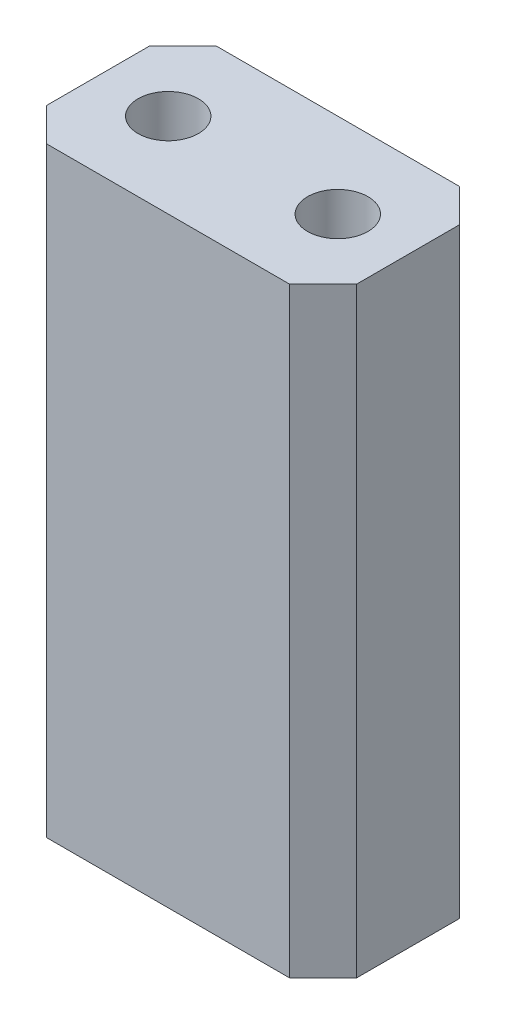
ISO-10303-21;
HEADER;
FILE_DESCRIPTION(('STEP AP214'),'2;1');
FILE_NAME('part.step','',(''),(''),'','','');
FILE_SCHEMA(('AUTOMOTIVE_DESIGN { 1 0 10303 214 1 1 1 1 }'));
ENDSEC;
DATA;
#1=APPLICATION_CONTEXT('core data for automotive mechanical design processes');
#2=APPLICATION_PROTOCOL_DEFINITION('international standard','automotive_design',2000,#1);
#3=PRODUCT_CONTEXT('',#1,'mechanical');
#4=PRODUCT('Part','Part','',(#3));
#5=PRODUCT_RELATED_PRODUCT_CATEGORY('part','',(#4));
#6=PRODUCT_DEFINITION_FORMATION('','',#4);
#7=PRODUCT_DEFINITION_CONTEXT('part definition',#1,'design');
#8=PRODUCT_DEFINITION('design','',#6,#7);
#9=PRODUCT_DEFINITION_SHAPE('','',#8);
#10=(LENGTH_UNIT() NAMED_UNIT(*) SI_UNIT(.MILLI.,.METRE.));
#11=(NAMED_UNIT(*) PLANE_ANGLE_UNIT() SI_UNIT($,.RADIAN.));
#12=(NAMED_UNIT(*) SI_UNIT($,.STERADIAN.) SOLID_ANGLE_UNIT());
#13=UNCERTAINTY_MEASURE_WITH_UNIT(LENGTH_MEASURE(1.E-05),#10,'distance_accuracy_value','');
#14=(GEOMETRIC_REPRESENTATION_CONTEXT(3) GLOBAL_UNCERTAINTY_ASSIGNED_CONTEXT((#13)) GLOBAL_UNIT_ASSIGNED_CONTEXT((#10,
#11,#12)) REPRESENTATION_CONTEXT('',''));
#15=CARTESIAN_POINT('',(0.,0.,0.));
#16=DIRECTION('',(0.,0.,1.));
#17=DIRECTION('',(1.,0.,0.));
#18=AXIS2_PLACEMENT_3D('',#15,#16,#17);
#19=CARTESIAN_POINT('',(0.,6.,0.));
#20=DIRECTION('',(0.,-1.,0.));
#21=DIRECTION('',(0.,0.,-1.));
#22=AXIS2_PLACEMENT_3D('',#19,#20,#21);
#23=PLANE('',#22);
#24=DIRECTION('',(0.,0.,-1.));
#25=VECTOR('',#24,1.);
#26=CARTESIAN_POINT('',(-0.95,6.,0.32));
#27=LINE('',#26,#25);
#28=CARTESIAN_POINT('',(-0.95,6.,0.32));
#29=VERTEX_POINT('',#28);
#30=CARTESIAN_POINT('',(-0.95,6.,-0.32));
#31=VERTEX_POINT('',#30);
#32=EDGE_CURVE('E163',#29,#31,#27,.T.);
#33=ORIENTED_EDGE('',*,*,#32,.F.);
#34=CARTESIAN_POINT('',(-1.27,6.,0.));
#35=DIRECTION('',(0.,1.,0.));
#36=DIRECTION('',(0.,0.,1.));
#37=AXIS2_PLACEMENT_3D('',#34,#35,#36);
#38=CIRCLE('',#37,0.45254833995939);
#39=EDGE_CURVE('E151',#29,#31,#38,.T.);
#40=ORIENTED_EDGE('',*,*,#39,.T.);
#41=EDGE_LOOP('',(#33,#40));
#42=FACE_BOUND('',#41,.T.);
#43=ADVANCED_FACE('F35',(#42),#23,.F.);
#44=DIRECTION('',(-1.,0.,0.));
#45=VECTOR('',#44,1.);
#46=CARTESIAN_POINT('',(-1.59,6.,-0.32));
#47=LINE('',#46,#45);
#48=CARTESIAN_POINT('',(-1.59,6.,-0.32));
#49=VERTEX_POINT('',#48);
#50=EDGE_CURVE('E176',#31,#49,#47,.T.);
#51=ORIENTED_EDGE('',*,*,#50,.F.);
#52=EDGE_CURVE('E148',#31,#49,#38,.T.);
#53=ORIENTED_EDGE('',*,*,#52,.T.);
#54=EDGE_LOOP('',(#51,#53));
#55=FACE_BOUND('',#54,.T.);
#56=ADVANCED_FACE('F187',(#55),#23,.F.);
#57=DIRECTION('',(0.,0.,1.));
#58=VECTOR('',#57,1.);
#59=CARTESIAN_POINT('',(-1.59,6.,0.32));
#60=LINE('',#59,#58);
#61=CARTESIAN_POINT('',(-1.59,6.,0.32));
#62=VERTEX_POINT('',#61);
#63=EDGE_CURVE('E188',#49,#62,#60,.T.);
#64=ORIENTED_EDGE('',*,*,#63,.F.);
#65=EDGE_CURVE('E154',#49,#62,#38,.T.);
#66=ORIENTED_EDGE('',*,*,#65,.T.);
#67=EDGE_LOOP('',(#64,#66));
#68=FACE_BOUND('',#67,.T.);
#69=ADVANCED_FACE('F361',(#68),#23,.F.);
#70=DIRECTION('',(1.,0.,0.));
#71=VECTOR('',#70,1.);
#72=CARTESIAN_POINT('',(-1.59,6.,0.32));
#73=LINE('',#72,#71);
#74=EDGE_CURVE('E191',#62,#29,#73,.T.);
#75=ORIENTED_EDGE('',*,*,#74,.F.);
#76=EDGE_CURVE('E166',#62,#29,#38,.T.);
#77=ORIENTED_EDGE('',*,*,#76,.T.);
#78=EDGE_LOOP('',(#75,#77));
#79=FACE_BOUND('',#78,.T.);
#80=ADVANCED_FACE('F365',(#79),#23,.F.);
#81=DIRECTION('',(0.,0.,-1.));
#82=VECTOR('',#81,1.);
#83=CARTESIAN_POINT('',(1.59,6.,0.32));
#84=LINE('',#83,#82);
#85=CARTESIAN_POINT('',(1.59,6.,0.32));
#86=VERTEX_POINT('',#85);
#87=CARTESIAN_POINT('',(1.59,6.,-0.320000000000001));
#88=VERTEX_POINT('',#87);
#89=EDGE_CURVE('E278',#86,#88,#84,.T.);
#90=ORIENTED_EDGE('',*,*,#89,.F.);
#91=CARTESIAN_POINT('',(1.27,6.,0.));
#92=DIRECTION('',(0.,1.,0.));
#93=DIRECTION('',(0.,0.,1.));
#94=AXIS2_PLACEMENT_3D('',#91,#92,#93);
#95=CIRCLE('',#94,0.452548339959391);
#96=EDGE_CURVE('E325',#86,#88,#95,.T.);
#97=ORIENTED_EDGE('',*,*,#96,.T.);
#98=EDGE_LOOP('',(#90,#97));
#99=FACE_BOUND('',#98,.T.);
#100=ADVANCED_FACE('F324',(#99),#23,.F.);
#101=DIRECTION('',(-1.,0.,0.));
#102=VECTOR('',#101,1.);
#103=CARTESIAN_POINT('',(0.95,6.,-0.32));
#104=LINE('',#103,#102);
#105=CARTESIAN_POINT('',(0.95,6.,-0.32));
#106=VERTEX_POINT('',#105);
#107=EDGE_CURVE('E281',#88,#106,#104,.T.);
#108=ORIENTED_EDGE('',*,*,#107,.F.);
#109=EDGE_CURVE('E329',#88,#106,#95,.T.);
#110=ORIENTED_EDGE('',*,*,#109,.T.);
#111=EDGE_LOOP('',(#108,#110));
#112=FACE_BOUND('',#111,.T.);
#113=ADVANCED_FACE('F342',(#112),#23,.F.);
#114=DIRECTION('',(0.,0.,1.));
#115=VECTOR('',#114,1.);
#116=CARTESIAN_POINT('',(0.95,6.,0.32));
#117=LINE('',#116,#115);
#118=CARTESIAN_POINT('',(0.95,6.,0.32));
#119=VERTEX_POINT('',#118);
#120=EDGE_CURVE('E285',#106,#119,#117,.T.);
#121=ORIENTED_EDGE('',*,*,#120,.F.);
#122=EDGE_CURVE('E334',#106,#119,#95,.T.);
#123=ORIENTED_EDGE('',*,*,#122,.T.);
#124=EDGE_LOOP('',(#121,#123));
#125=FACE_BOUND('',#124,.T.);
#126=ADVANCED_FACE('F339',(#125),#23,.F.);
#127=DIRECTION('',(1.,0.,0.));
#128=VECTOR('',#127,1.);
#129=CARTESIAN_POINT('',(0.95,6.,0.32));
#130=LINE('',#129,#128);
#131=EDGE_CURVE('E288',#119,#86,#130,.T.);
#132=ORIENTED_EDGE('',*,*,#131,.F.);
#133=EDGE_CURVE('E220',#119,#86,#95,.T.);
#134=ORIENTED_EDGE('',*,*,#133,.T.);
#135=EDGE_LOOP('',(#132,#134));
#136=FACE_BOUND('',#135,.T.);
#137=ADVANCED_FACE('F347',(#136),#23,.F.);
#138=CARTESIAN_POINT('',(0.,0.,0.));
#139=DIRECTION('',(0.,-1.,0.));
#140=DIRECTION('',(0.,0.,-1.));
#141=AXIS2_PLACEMENT_3D('',#138,#139,#140);
#142=PLANE('',#141);
#143=DIRECTION('',(0.,0.,-1.));
#144=VECTOR('',#143,1.);
#145=CARTESIAN_POINT('',(2.32,0.,1.27));
#146=LINE('',#145,#144);
#147=CARTESIAN_POINT('',(2.32,0.,0.77));
#148=VERTEX_POINT('',#147);
#149=CARTESIAN_POINT('',(2.32,0.,-0.769999999999999));
#150=VERTEX_POINT('',#149);
#151=EDGE_CURVE('E184',#148,#150,#146,.T.);
#152=ORIENTED_EDGE('',*,*,#151,.F.);
#153=DIRECTION('',(0.707106781186549,0.,-0.707106781186546));
#154=VECTOR('',#153,1.);
#155=CARTESIAN_POINT('',(1.545,0.,1.545));
#156=LINE('',#155,#154);
#157=CARTESIAN_POINT('',(1.82,0.,1.27));
#158=VERTEX_POINT('',#157);
#159=EDGE_CURVE('E231',#148,#158,#156,.F.);
#160=ORIENTED_EDGE('',*,*,#159,.T.);
#161=DIRECTION('',(1.,0.,0.));
#162=VECTOR('',#161,1.);
#163=CARTESIAN_POINT('',(-2.32,0.,1.27));
#164=LINE('',#163,#162);
#165=CARTESIAN_POINT('',(-1.82,0.,1.27));
#166=VERTEX_POINT('',#165);
#167=EDGE_CURVE('E217',#166,#158,#164,.T.);
#168=ORIENTED_EDGE('',*,*,#167,.F.);
#169=DIRECTION('',(0.707106781186546,0.,0.707106781186549));
#170=VECTOR('',#169,1.);
#171=CARTESIAN_POINT('',(-1.545,0.,1.545));
#172=LINE('',#171,#170);
#173=CARTESIAN_POINT('',(-2.32,0.,0.769999999999998));
#174=VERTEX_POINT('',#173);
#175=EDGE_CURVE('E229',#166,#174,#172,.F.);
#176=ORIENTED_EDGE('',*,*,#175,.T.);
#177=DIRECTION('',(0.,0.,1.));
#178=VECTOR('',#177,1.);
#179=CARTESIAN_POINT('',(-2.32,0.,-1.27));
#180=LINE('',#179,#178);
#181=CARTESIAN_POINT('',(-2.32,0.,-0.77));
#182=VERTEX_POINT('',#181);
#183=EDGE_CURVE('E215',#182,#174,#180,.T.);
#184=ORIENTED_EDGE('',*,*,#183,.F.);
#185=DIRECTION('',(-0.707106781186549,0.,0.707106781186546));
#186=VECTOR('',#185,1.);
#187=CARTESIAN_POINT('',(-1.545,0.,-1.545));
#188=LINE('',#187,#186);
#189=CARTESIAN_POINT('',(-1.82,0.,-1.27));
#190=VERTEX_POINT('',#189);
#191=EDGE_CURVE('E227',#182,#190,#188,.F.);
#192=ORIENTED_EDGE('',*,*,#191,.T.);
#193=DIRECTION('',(-1.,0.,0.));
#194=VECTOR('',#193,1.);
#195=CARTESIAN_POINT('',(-2.32,0.,-1.27));
#196=LINE('',#195,#194);
#197=CARTESIAN_POINT('',(1.82,0.,-1.27));
#198=VERTEX_POINT('',#197);
#199=EDGE_CURVE('E212',#198,#190,#196,.T.);
#200=ORIENTED_EDGE('',*,*,#199,.F.);
#201=DIRECTION('',(-0.707106781186546,0.,-0.707106781186549));
#202=VECTOR('',#201,1.);
#203=CARTESIAN_POINT('',(1.54500000000001,0.,-1.545));
#204=LINE('',#203,#202);
#205=EDGE_CURVE('E225',#198,#150,#204,.F.);
#206=ORIENTED_EDGE('',*,*,#205,.T.);
#207=EDGE_LOOP('',(#152,#160,#168,#176,#184,#192,#200,#206));
#208=FACE_BOUND('',#207,.T.);
#209=DIRECTION('',(1.,0.,0.));
#210=VECTOR('',#209,1.);
#211=CARTESIAN_POINT('',(-1.59,0.,0.32));
#212=LINE('',#211,#210);
#213=CARTESIAN_POINT('',(-1.59,0.,0.32));
#214=VERTEX_POINT('',#213);
#215=CARTESIAN_POINT('',(-0.95,0.,0.32));
#216=VERTEX_POINT('',#215);
#217=EDGE_CURVE('E177',#214,#216,#212,.T.);
#218=ORIENTED_EDGE('',*,*,#217,.T.);
#219=DIRECTION('',(0.,0.,-1.));
#220=VECTOR('',#219,1.);
#221=CARTESIAN_POINT('',(-0.95,0.,0.32));
#222=LINE('',#221,#220);
#223=CARTESIAN_POINT('',(-0.95,0.,-0.32));
#224=VERTEX_POINT('',#223);
#225=EDGE_CURVE('E197',#216,#224,#222,.T.);
#226=ORIENTED_EDGE('',*,*,#225,.T.);
#227=DIRECTION('',(-1.,0.,0.));
#228=VECTOR('',#227,1.);
#229=CARTESIAN_POINT('',(-1.59,0.,-0.32));
#230=LINE('',#229,#228);
#231=CARTESIAN_POINT('',(-1.59,0.,-0.32));
#232=VERTEX_POINT('',#231);
#233=EDGE_CURVE('E183',#224,#232,#230,.T.);
#234=ORIENTED_EDGE('',*,*,#233,.T.);
#235=DIRECTION('',(0.,0.,1.));
#236=VECTOR('',#235,1.);
#237=CARTESIAN_POINT('',(-1.59,0.,0.32));
#238=LINE('',#237,#236);
#239=EDGE_CURVE('E201',#232,#214,#238,.T.);
#240=ORIENTED_EDGE('',*,*,#239,.T.);
#241=EDGE_LOOP('',(#218,#226,#234,#240));
#242=FACE_BOUND('',#241,.T.);
#243=DIRECTION('',(1.,0.,0.));
#244=VECTOR('',#243,1.);
#245=CARTESIAN_POINT('',(0.95,0.,0.32));
#246=LINE('',#245,#244);
#247=CARTESIAN_POINT('',(0.95,0.,0.32));
#248=VERTEX_POINT('',#247);
#249=CARTESIAN_POINT('',(1.59,0.,0.32));
#250=VERTEX_POINT('',#249);
#251=EDGE_CURVE('E282',#248,#250,#246,.T.);
#252=ORIENTED_EDGE('',*,*,#251,.T.);
#253=DIRECTION('',(0.,0.,-1.));
#254=VECTOR('',#253,1.);
#255=CARTESIAN_POINT('',(1.59,0.,0.32));
#256=LINE('',#255,#254);
#257=CARTESIAN_POINT('',(1.59,0.,-0.32));
#258=VERTEX_POINT('',#257);
#259=EDGE_CURVE('E272',#250,#258,#256,.T.);
#260=ORIENTED_EDGE('',*,*,#259,.T.);
#261=DIRECTION('',(-1.,0.,0.));
#262=VECTOR('',#261,1.);
#263=CARTESIAN_POINT('',(0.95,0.,-0.32));
#264=LINE('',#263,#262);
#265=CARTESIAN_POINT('',(0.95,0.,-0.32));
#266=VERTEX_POINT('',#265);
#267=EDGE_CURVE('E294',#258,#266,#264,.T.);
#268=ORIENTED_EDGE('',*,*,#267,.T.);
#269=DIRECTION('',(0.,0.,1.));
#270=VECTOR('',#269,1.);
#271=CARTESIAN_POINT('',(0.95,0.,0.32));
#272=LINE('',#271,#270);
#273=EDGE_CURVE('E297',#266,#248,#272,.T.);
#274=ORIENTED_EDGE('',*,*,#273,.T.);
#275=EDGE_LOOP('',(#252,#260,#268,#274));
#276=FACE_BOUND('',#275,.T.);
#277=ADVANCED_FACE('F260',(#208,#242,#276),#142,.T.);
#278=CARTESIAN_POINT('',(2.32,6.,1.27));
#279=DIRECTION('',(-1.,0.,0.));
#280=DIRECTION('',(0.,0.,1.));
#281=AXIS2_PLACEMENT_3D('',#278,#279,#280);
#282=PLANE('',#281);
#283=DIRECTION('',(0.,0.,-1.));
#284=VECTOR('',#283,1.);
#285=CARTESIAN_POINT('',(2.32,9.,1.27));
#286=LINE('',#285,#284);
#287=CARTESIAN_POINT('',(2.32,9.,0.77));
#288=VERTEX_POINT('',#287);
#289=CARTESIAN_POINT('',(2.32,9.,-0.769999999999999));
#290=VERTEX_POINT('',#289);
#291=EDGE_CURVE('E274',#288,#290,#286,.T.);
#292=ORIENTED_EDGE('',*,*,#291,.F.);
#293=DIRECTION('',(0.,-1.,0.));
#294=VECTOR('',#293,1.);
#295=CARTESIAN_POINT('',(2.32,6.,0.77));
#296=LINE('',#295,#294);
#297=EDGE_CURVE('E222',#288,#148,#296,.T.);
#298=ORIENTED_EDGE('',*,*,#297,.T.);
#299=ORIENTED_EDGE('',*,*,#151,.T.);
#300=DIRECTION('',(0.,1.,0.));
#301=VECTOR('',#300,1.);
#302=CARTESIAN_POINT('',(2.32,6.,-0.769999999999999));
#303=LINE('',#302,#301);
#304=EDGE_CURVE('E158',#150,#290,#303,.T.);
#305=ORIENTED_EDGE('',*,*,#304,.T.);
#306=EDGE_LOOP('',(#292,#298,#299,#305));
#307=FACE_BOUND('',#306,.T.);
#308=ADVANCED_FACE('F354',(#307),#282,.F.);
#309=CARTESIAN_POINT('',(-2.32,6.,-1.27));
#310=DIRECTION('',(0.,0.,1.));
#311=DIRECTION('',(1.,0.,0.));
#312=AXIS2_PLACEMENT_3D('',#309,#310,#311);
#313=PLANE('',#312);
#314=ORIENTED_EDGE('',*,*,#199,.T.);
#315=DIRECTION('',(0.,1.,0.));
#316=VECTOR('',#315,1.);
#317=CARTESIAN_POINT('',(-1.82,6.,-1.27));
#318=LINE('',#317,#316);
#319=CARTESIAN_POINT('',(-1.82,9.,-1.27));
#320=VERTEX_POINT('',#319);
#321=EDGE_CURVE('E11',#190,#320,#318,.T.);
#322=ORIENTED_EDGE('',*,*,#321,.T.);
#323=DIRECTION('',(-1.,0.,0.));
#324=VECTOR('',#323,1.);
#325=CARTESIAN_POINT('',(-2.32,9.,-1.27));
#326=LINE('',#325,#324);
#327=CARTESIAN_POINT('',(1.82,9.,-1.27));
#328=VERTEX_POINT('',#327);
#329=EDGE_CURVE('E255',#328,#320,#326,.T.);
#330=ORIENTED_EDGE('',*,*,#329,.F.);
#331=DIRECTION('',(0.,-1.,0.));
#332=VECTOR('',#331,1.);
#333=CARTESIAN_POINT('',(1.82,6.,-1.27));
#334=LINE('',#333,#332);
#335=EDGE_CURVE('E43',#328,#198,#334,.T.);
#336=ORIENTED_EDGE('',*,*,#335,.T.);
#337=EDGE_LOOP('',(#314,#322,#330,#336));
#338=FACE_BOUND('',#337,.T.);
#339=ADVANCED_FACE('F253',(#338),#313,.F.);
#340=CARTESIAN_POINT('',(-2.32,6.,-1.27));
#341=DIRECTION('',(1.,0.,0.));
#342=DIRECTION('',(0.,0.,-1.));
#343=AXIS2_PLACEMENT_3D('',#340,#341,#342);
#344=PLANE('',#343);
#345=ORIENTED_EDGE('',*,*,#183,.T.);
#346=DIRECTION('',(0.,1.,0.));
#347=VECTOR('',#346,1.);
#348=CARTESIAN_POINT('',(-2.32,6.,0.769999999999998));
#349=LINE('',#348,#347);
#350=CARTESIAN_POINT('',(-2.32,9.,0.769999999999998));
#351=VERTEX_POINT('',#350);
#352=EDGE_CURVE('E50',#174,#351,#349,.T.);
#353=ORIENTED_EDGE('',*,*,#352,.T.);
#354=DIRECTION('',(0.,0.,1.));
#355=VECTOR('',#354,1.);
#356=CARTESIAN_POINT('',(-2.32,9.,1.27));
#357=LINE('',#356,#355);
#358=CARTESIAN_POINT('',(-2.32,9.,-0.77));
#359=VERTEX_POINT('',#358);
#360=EDGE_CURVE('E267',#359,#351,#357,.T.);
#361=ORIENTED_EDGE('',*,*,#360,.F.);
#362=DIRECTION('',(0.,-1.,0.));
#363=VECTOR('',#362,1.);
#364=CARTESIAN_POINT('',(-2.32,6.,-0.77));
#365=LINE('',#364,#363);
#366=EDGE_CURVE('E245',#359,#182,#365,.T.);
#367=ORIENTED_EDGE('',*,*,#366,.T.);
#368=EDGE_LOOP('',(#345,#353,#361,#367));
#369=FACE_BOUND('',#368,.T.);
#370=ADVANCED_FACE('F266',(#369),#344,.F.);
#371=CARTESIAN_POINT('',(-2.32,6.,1.27));
#372=DIRECTION('',(0.,0.,-1.));
#373=DIRECTION('',(-1.,0.,0.));
#374=AXIS2_PLACEMENT_3D('',#371,#372,#373);
#375=PLANE('',#374);
#376=ORIENTED_EDGE('',*,*,#167,.T.);
#377=DIRECTION('',(0.,1.,0.));
#378=VECTOR('',#377,1.);
#379=CARTESIAN_POINT('',(1.82,6.,1.27));
#380=LINE('',#379,#378);
#381=CARTESIAN_POINT('',(1.82,9.,1.27));
#382=VERTEX_POINT('',#381);
#383=EDGE_CURVE('E236',#158,#382,#380,.T.);
#384=ORIENTED_EDGE('',*,*,#383,.T.);
#385=DIRECTION('',(1.,0.,0.));
#386=VECTOR('',#385,1.);
#387=CARTESIAN_POINT('',(-2.32,9.,1.27));
#388=LINE('',#387,#386);
#389=CARTESIAN_POINT('',(-1.82,9.,1.27));
#390=VERTEX_POINT('',#389);
#391=EDGE_CURVE('E269',#390,#382,#388,.T.);
#392=ORIENTED_EDGE('',*,*,#391,.F.);
#393=DIRECTION('',(0.,-1.,0.));
#394=VECTOR('',#393,1.);
#395=CARTESIAN_POINT('',(-1.82,6.,1.27));
#396=LINE('',#395,#394);
#397=EDGE_CURVE('E233',#390,#166,#396,.T.);
#398=ORIENTED_EDGE('',*,*,#397,.T.);
#399=EDGE_LOOP('',(#376,#384,#392,#398));
#400=FACE_BOUND('',#399,.T.);
#401=ADVANCED_FACE('F392',(#400),#375,.F.);
#402=CARTESIAN_POINT('',(-0.95,6.,0.32));
#403=DIRECTION('',(-1.,0.,0.));
#404=DIRECTION('',(0.,0.,1.));
#405=AXIS2_PLACEMENT_3D('',#402,#403,#404);
#406=PLANE('',#405);
#407=ORIENTED_EDGE('',*,*,#225,.F.);
#408=DIRECTION('',(0.,-1.,0.));
#409=VECTOR('',#408,1.);
#410=CARTESIAN_POINT('',(-0.95,6.,0.32));
#411=LINE('',#410,#409);
#412=EDGE_CURVE('E175',#29,#216,#411,.T.);
#413=ORIENTED_EDGE('',*,*,#412,.F.);
#414=ORIENTED_EDGE('',*,*,#32,.T.);
#415=DIRECTION('',(0.,-1.,0.));
#416=VECTOR('',#415,1.);
#417=CARTESIAN_POINT('',(-0.95,6.,-0.32));
#418=LINE('',#417,#416);
#419=EDGE_CURVE('E172',#31,#224,#418,.T.);
#420=ORIENTED_EDGE('',*,*,#419,.T.);
#421=EDGE_LOOP('',(#407,#413,#414,#420));
#422=FACE_BOUND('',#421,.T.);
#423=ADVANCED_FACE('F171',(#422),#406,.T.);
#424=CARTESIAN_POINT('',(-1.59,6.,-0.32));
#425=DIRECTION('',(0.,0.,1.));
#426=DIRECTION('',(1.,0.,0.));
#427=AXIS2_PLACEMENT_3D('',#424,#425,#426);
#428=PLANE('',#427);
#429=ORIENTED_EDGE('',*,*,#233,.F.);
#430=ORIENTED_EDGE('',*,*,#419,.F.);
#431=ORIENTED_EDGE('',*,*,#50,.T.);
#432=DIRECTION('',(0.,-1.,0.));
#433=VECTOR('',#432,1.);
#434=CARTESIAN_POINT('',(-1.59,6.,-0.32));
#435=LINE('',#434,#433);
#436=EDGE_CURVE('E185',#49,#232,#435,.T.);
#437=ORIENTED_EDGE('',*,*,#436,.T.);
#438=EDGE_LOOP('',(#429,#430,#431,#437));
#439=FACE_BOUND('',#438,.T.);
#440=ADVANCED_FACE('F180',(#439),#428,.T.);
#441=CARTESIAN_POINT('',(-1.59,6.,0.32));
#442=DIRECTION('',(1.,0.,0.));
#443=DIRECTION('',(0.,0.,-1.));
#444=AXIS2_PLACEMENT_3D('',#441,#442,#443);
#445=PLANE('',#444);
#446=ORIENTED_EDGE('',*,*,#239,.F.);
#447=ORIENTED_EDGE('',*,*,#436,.F.);
#448=ORIENTED_EDGE('',*,*,#63,.T.);
#449=DIRECTION('',(0.,-1.,0.));
#450=VECTOR('',#449,1.);
#451=CARTESIAN_POINT('',(-1.59,6.,0.32));
#452=LINE('',#451,#450);
#453=EDGE_CURVE('E207',#62,#214,#452,.T.);
#454=ORIENTED_EDGE('',*,*,#453,.T.);
#455=EDGE_LOOP('',(#446,#447,#448,#454));
#456=FACE_BOUND('',#455,.T.);
#457=ADVANCED_FACE('F376',(#456),#445,.T.);
#458=CARTESIAN_POINT('',(-1.59,6.,0.32));
#459=DIRECTION('',(0.,0.,-1.));
#460=DIRECTION('',(-1.,0.,0.));
#461=AXIS2_PLACEMENT_3D('',#458,#459,#460);
#462=PLANE('',#461);
#463=ORIENTED_EDGE('',*,*,#217,.F.);
#464=ORIENTED_EDGE('',*,*,#453,.F.);
#465=ORIENTED_EDGE('',*,*,#74,.T.);
#466=ORIENTED_EDGE('',*,*,#412,.T.);
#467=EDGE_LOOP('',(#463,#464,#465,#466));
#468=FACE_BOUND('',#467,.T.);
#469=ADVANCED_FACE('F379',(#468),#462,.T.);
#470=CARTESIAN_POINT('',(1.59,6.,0.32));
#471=DIRECTION('',(-1.,0.,0.));
#472=DIRECTION('',(0.,0.,1.));
#473=AXIS2_PLACEMENT_3D('',#470,#471,#472);
#474=PLANE('',#473);
#475=ORIENTED_EDGE('',*,*,#259,.F.);
#476=DIRECTION('',(0.,-1.,0.));
#477=VECTOR('',#476,1.);
#478=CARTESIAN_POINT('',(1.59,6.,0.32));
#479=LINE('',#478,#477);
#480=EDGE_CURVE('E291',#86,#250,#479,.T.);
#481=ORIENTED_EDGE('',*,*,#480,.F.);
#482=ORIENTED_EDGE('',*,*,#89,.T.);
#483=DIRECTION('',(0.,-1.,0.));
#484=VECTOR('',#483,1.);
#485=CARTESIAN_POINT('',(1.59,6.,-0.32));
#486=LINE('',#485,#484);
#487=EDGE_CURVE('E199',#88,#258,#486,.T.);
#488=ORIENTED_EDGE('',*,*,#487,.T.);
#489=EDGE_LOOP('',(#475,#481,#482,#488));
#490=FACE_BOUND('',#489,.T.);
#491=ADVANCED_FACE('F310',(#490),#474,.T.);
#492=CARTESIAN_POINT('',(0.95,6.,-0.32));
#493=DIRECTION('',(0.,0.,1.));
#494=DIRECTION('',(1.,0.,0.));
#495=AXIS2_PLACEMENT_3D('',#492,#493,#494);
#496=PLANE('',#495);
#497=ORIENTED_EDGE('',*,*,#267,.F.);
#498=ORIENTED_EDGE('',*,*,#487,.F.);
#499=ORIENTED_EDGE('',*,*,#107,.T.);
#500=DIRECTION('',(0.,-1.,0.));
#501=VECTOR('',#500,1.);
#502=CARTESIAN_POINT('',(0.95,6.,-0.32));
#503=LINE('',#502,#501);
#504=EDGE_CURVE('E306',#106,#266,#503,.T.);
#505=ORIENTED_EDGE('',*,*,#504,.T.);
#506=EDGE_LOOP('',(#497,#498,#499,#505));
#507=FACE_BOUND('',#506,.T.);
#508=ADVANCED_FACE('F344',(#507),#496,.T.);
#509=CARTESIAN_POINT('',(0.95,6.,0.32));
#510=DIRECTION('',(1.,0.,0.));
#511=DIRECTION('',(0.,0.,-1.));
#512=AXIS2_PLACEMENT_3D('',#509,#510,#511);
#513=PLANE('',#512);
#514=ORIENTED_EDGE('',*,*,#273,.F.);
#515=ORIENTED_EDGE('',*,*,#504,.F.);
#516=ORIENTED_EDGE('',*,*,#120,.T.);
#517=DIRECTION('',(0.,-1.,0.));
#518=VECTOR('',#517,1.);
#519=CARTESIAN_POINT('',(0.95,6.,0.32));
#520=LINE('',#519,#518);
#521=EDGE_CURVE('E304',#119,#248,#520,.T.);
#522=ORIENTED_EDGE('',*,*,#521,.T.);
#523=EDGE_LOOP('',(#514,#515,#516,#522));
#524=FACE_BOUND('',#523,.T.);
#525=ADVANCED_FACE('F346',(#524),#513,.T.);
#526=CARTESIAN_POINT('',(0.95,6.,0.32));
#527=DIRECTION('',(0.,0.,-1.));
#528=DIRECTION('',(-1.,0.,0.));
#529=AXIS2_PLACEMENT_3D('',#526,#527,#528);
#530=PLANE('',#529);
#531=ORIENTED_EDGE('',*,*,#251,.F.);
#532=ORIENTED_EDGE('',*,*,#521,.F.);
#533=ORIENTED_EDGE('',*,*,#131,.T.);
#534=ORIENTED_EDGE('',*,*,#480,.T.);
#535=EDGE_LOOP('',(#531,#532,#533,#534));
#536=FACE_BOUND('',#535,.T.);
#537=ADVANCED_FACE('F320',(#536),#530,.T.);
#538=CARTESIAN_POINT('',(0.,9.,0.));
#539=DIRECTION('',(0.,-1.,0.));
#540=DIRECTION('',(0.,0.,-1.));
#541=AXIS2_PLACEMENT_3D('',#538,#539,#540);
#542=PLANE('',#541);
#543=ORIENTED_EDGE('',*,*,#391,.T.);
#544=DIRECTION('',(-0.707106781186549,0.,0.707106781186546));
#545=VECTOR('',#544,1.);
#546=CARTESIAN_POINT('',(2.32,9.,0.77));
#547=LINE('',#546,#545);
#548=EDGE_CURVE('E243',#382,#288,#547,.F.);
#549=ORIENTED_EDGE('',*,*,#548,.T.);
#550=ORIENTED_EDGE('',*,*,#291,.T.);
#551=DIRECTION('',(0.707106781186546,0.,0.707106781186549));
#552=VECTOR('',#551,1.);
#553=CARTESIAN_POINT('',(1.82,9.,-1.27));
#554=LINE('',#553,#552);
#555=EDGE_CURVE('E238',#290,#328,#554,.F.);
#556=ORIENTED_EDGE('',*,*,#555,.T.);
#557=ORIENTED_EDGE('',*,*,#329,.T.);
#558=DIRECTION('',(0.707106781186549,0.,-0.707106781186546));
#559=VECTOR('',#558,1.);
#560=CARTESIAN_POINT('',(-2.32,9.,-0.77));
#561=LINE('',#560,#559);
#562=EDGE_CURVE('E57',#320,#359,#561,.F.);
#563=ORIENTED_EDGE('',*,*,#562,.T.);
#564=ORIENTED_EDGE('',*,*,#360,.T.);
#565=DIRECTION('',(-0.707106781186546,0.,-0.707106781186549));
#566=VECTOR('',#565,1.);
#567=CARTESIAN_POINT('',(-1.82,9.,1.27));
#568=LINE('',#567,#566);
#569=EDGE_CURVE('E241',#351,#390,#568,.F.);
#570=ORIENTED_EDGE('',*,*,#569,.T.);
#571=EDGE_LOOP('',(#543,#549,#550,#556,#557,#563,#564,#570));
#572=FACE_BOUND('',#571,.T.);
#573=CARTESIAN_POINT('',(-1.27,9.,0.));
#574=DIRECTION('',(0.,1.,0.));
#575=DIRECTION('',(0.,0.,1.));
#576=AXIS2_PLACEMENT_3D('',#573,#574,#575);
#577=CIRCLE('',#576,0.45254833995939);
#578=CARTESIAN_POINT('',(-1.27,9.,0.45254833995939));
#579=VERTEX_POINT('',#578);
#580=EDGE_CURVE('E164',#579,#579,#577,.T.);
#581=ORIENTED_EDGE('',*,*,#580,.F.);
#582=EDGE_LOOP('',(#581));
#583=FACE_BOUND('',#582,.T.);
#584=CARTESIAN_POINT('',(1.27,9.,0.));
#585=DIRECTION('',(0.,1.,0.));
#586=DIRECTION('',(0.,0.,1.));
#587=AXIS2_PLACEMENT_3D('',#584,#585,#586);
#588=CIRCLE('',#587,0.452548339959391);
#589=CARTESIAN_POINT('',(1.27,9.,0.452548339959391));
#590=VERTEX_POINT('',#589);
#591=EDGE_CURVE('E165',#590,#590,#588,.T.);
#592=ORIENTED_EDGE('',*,*,#591,.F.);
#593=EDGE_LOOP('',(#592));
#594=FACE_BOUND('',#593,.T.);
#595=ADVANCED_FACE('F423',(#572,#583,#594),#542,.F.);
#596=CARTESIAN_POINT('',(-1.27,9.,0.));
#597=DIRECTION('',(0.,-1.,0.));
#598=DIRECTION('',(0.,0.,-1.));
#599=AXIS2_PLACEMENT_3D('',#596,#597,#598);
#600=CYLINDRICAL_SURFACE('',#599,0.45254833995939);
#601=ORIENTED_EDGE('',*,*,#580,.T.);
#602=EDGE_LOOP('',(#601));
#603=FACE_BOUND('',#602,.T.);
#604=ORIENTED_EDGE('',*,*,#39,.F.);
#605=ORIENTED_EDGE('',*,*,#76,.F.);
#606=ORIENTED_EDGE('',*,*,#65,.F.);
#607=ORIENTED_EDGE('',*,*,#52,.F.);
#608=EDGE_LOOP('',(#604,#605,#606,#607));
#609=FACE_BOUND('',#608,.T.);
#610=ADVANCED_FACE('F150',(#603,#609),#600,.F.);
#611=CARTESIAN_POINT('',(1.27,9.,0.));
#612=DIRECTION('',(0.,-1.,0.));
#613=DIRECTION('',(0.,0.,-1.));
#614=AXIS2_PLACEMENT_3D('',#611,#612,#613);
#615=CYLINDRICAL_SURFACE('',#614,0.452548339959391);
#616=ORIENTED_EDGE('',*,*,#591,.T.);
#617=EDGE_LOOP('',(#616));
#618=FACE_BOUND('',#617,.T.);
#619=ORIENTED_EDGE('',*,*,#96,.F.);
#620=ORIENTED_EDGE('',*,*,#133,.F.);
#621=ORIENTED_EDGE('',*,*,#122,.F.);
#622=ORIENTED_EDGE('',*,*,#109,.F.);
#623=EDGE_LOOP('',(#619,#620,#621,#622));
#624=FACE_BOUND('',#623,.T.);
#625=ADVANCED_FACE('F340',(#618,#624),#615,.F.);
#626=CARTESIAN_POINT('',(2.32,6.,0.77));
#627=DIRECTION('',(-0.707106781186546,0.,-0.707106781186549));
#628=DIRECTION('',(0.,-1.,0.));
#629=AXIS2_PLACEMENT_3D('',#626,#627,#628);
#630=PLANE('',#629);
#631=ORIENTED_EDGE('',*,*,#548,.F.);
#632=ORIENTED_EDGE('',*,*,#383,.F.);
#633=ORIENTED_EDGE('',*,*,#159,.F.);
#634=ORIENTED_EDGE('',*,*,#297,.F.);
#635=EDGE_LOOP('',(#631,#632,#633,#634));
#636=FACE_BOUND('',#635,.T.);
#637=ADVANCED_FACE('F408',(#636),#630,.F.);
#638=CARTESIAN_POINT('',(-1.82,6.,1.27));
#639=DIRECTION('',(0.707106781186549,0.,-0.707106781186546));
#640=DIRECTION('',(0.,-1.,0.));
#641=AXIS2_PLACEMENT_3D('',#638,#639,#640);
#642=PLANE('',#641);
#643=ORIENTED_EDGE('',*,*,#569,.F.);
#644=ORIENTED_EDGE('',*,*,#352,.F.);
#645=ORIENTED_EDGE('',*,*,#175,.F.);
#646=ORIENTED_EDGE('',*,*,#397,.F.);
#647=EDGE_LOOP('',(#643,#644,#645,#646));
#648=FACE_BOUND('',#647,.T.);
#649=ADVANCED_FACE('F411',(#648),#642,.F.);
#650=CARTESIAN_POINT('',(-2.32,6.,-0.77));
#651=DIRECTION('',(0.707106781186546,0.,0.707106781186549));
#652=DIRECTION('',(0.,-1.,0.));
#653=AXIS2_PLACEMENT_3D('',#650,#651,#652);
#654=PLANE('',#653);
#655=ORIENTED_EDGE('',*,*,#562,.F.);
#656=ORIENTED_EDGE('',*,*,#321,.F.);
#657=ORIENTED_EDGE('',*,*,#191,.F.);
#658=ORIENTED_EDGE('',*,*,#366,.F.);
#659=EDGE_LOOP('',(#655,#656,#657,#658));
#660=FACE_BOUND('',#659,.T.);
#661=ADVANCED_FACE('F265',(#660),#654,.F.);
#662=CARTESIAN_POINT('',(1.82,6.,-1.27));
#663=DIRECTION('',(-0.707106781186549,0.,0.707106781186546));
#664=DIRECTION('',(0.,-1.,0.));
#665=AXIS2_PLACEMENT_3D('',#662,#663,#664);
#666=PLANE('',#665);
#667=ORIENTED_EDGE('',*,*,#555,.F.);
#668=ORIENTED_EDGE('',*,*,#304,.F.);
#669=ORIENTED_EDGE('',*,*,#205,.F.);
#670=ORIENTED_EDGE('',*,*,#335,.F.);
#671=EDGE_LOOP('',(#667,#668,#669,#670));
#672=FACE_BOUND('',#671,.T.);
#673=ADVANCED_FACE('F37',(#672),#666,.F.);
#674=CLOSED_SHELL('',(#43,#56,#69,#80,#100,#113,#126,#137,#277,#308,#339,#370,#401,#423,#440,
#457,#469,#491,#508,#525,#537,#595,#610,#625,#637,#649,#661,#673));
#675=MANIFOLD_SOLID_BREP('B2',#674);
#676=ADVANCED_BREP_SHAPE_REPRESENTATION('',(#18,#675),#14);
#677=SHAPE_DEFINITION_REPRESENTATION(#9,#676);
ENDSEC;
END-ISO-10303-21;
